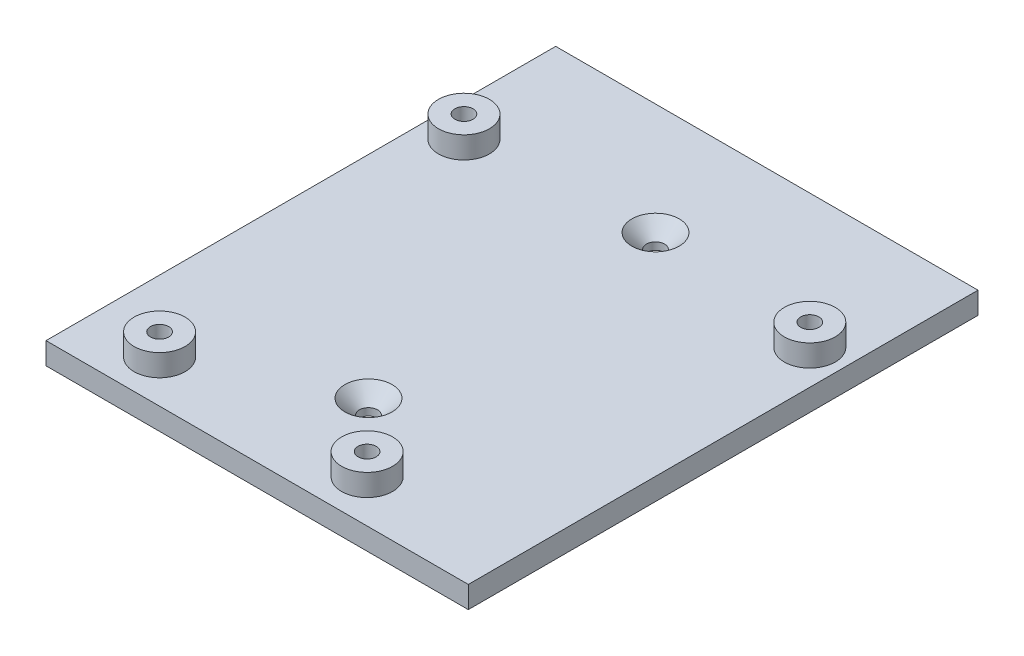
ISO-10303-21;
HEADER;
FILE_DESCRIPTION(('STEP AP214'),'2;1');
FILE_NAME('part.step','',(''),(''),'','','');
FILE_SCHEMA(('AUTOMOTIVE_DESIGN { 1 0 10303 214 1 1 1 1 }'));
ENDSEC;
DATA;
#1=APPLICATION_CONTEXT('core data for automotive mechanical design processes');
#2=APPLICATION_PROTOCOL_DEFINITION('international standard','automotive_design',2000,#1);
#3=PRODUCT_CONTEXT('',#1,'mechanical');
#4=PRODUCT('Part','Part','',(#3));
#5=PRODUCT_RELATED_PRODUCT_CATEGORY('part','',(#4));
#6=PRODUCT_DEFINITION_FORMATION('','',#4);
#7=PRODUCT_DEFINITION_CONTEXT('part definition',#1,'design');
#8=PRODUCT_DEFINITION('design','',#6,#7);
#9=PRODUCT_DEFINITION_SHAPE('','',#8);
#10=(LENGTH_UNIT() NAMED_UNIT(*) SI_UNIT(.MILLI.,.METRE.));
#11=(NAMED_UNIT(*) PLANE_ANGLE_UNIT() SI_UNIT($,.RADIAN.));
#12=(NAMED_UNIT(*) SI_UNIT($,.STERADIAN.) SOLID_ANGLE_UNIT());
#13=UNCERTAINTY_MEASURE_WITH_UNIT(LENGTH_MEASURE(1.E-05),#10,'distance_accuracy_value','');
#14=(GEOMETRIC_REPRESENTATION_CONTEXT(3) GLOBAL_UNCERTAINTY_ASSIGNED_CONTEXT((#13)) GLOBAL_UNIT_ASSIGNED_CONTEXT((#10,
#11,#12)) REPRESENTATION_CONTEXT('',''));
#15=CARTESIAN_POINT('',(0.,0.,0.));
#16=DIRECTION('',(0.,0.,1.));
#17=DIRECTION('',(1.,0.,0.));
#18=AXIS2_PLACEMENT_3D('',#15,#16,#17);
#19=CARTESIAN_POINT('',(-24.9419349390868,3.,-13.9533386698621));
#20=DIRECTION('',(1.,0.,0.));
#21=DIRECTION('',(0.,0.,-1.));
#22=AXIS2_PLACEMENT_3D('',#19,#20,#21);
#23=PLANE('',#22);
#24=DIRECTION('',(0.,0.,1.));
#25=VECTOR('',#24,1.);
#26=CARTESIAN_POINT('',(-24.9419349390868,0.,-13.9533386698621));
#27=LINE('',#26,#25);
#28=CARTESIAN_POINT('',(-24.9419349390868,0.,-13.9533386698621));
#29=VERTEX_POINT('',#28);
#30=CARTESIAN_POINT('',(-24.9419349390868,0.,56.0466613301379));
#31=VERTEX_POINT('',#30);
#32=EDGE_CURVE('E112',#29,#31,#27,.T.);
#33=ORIENTED_EDGE('',*,*,#32,.T.);
#34=DIRECTION('',(0.,-1.,0.));
#35=VECTOR('',#34,1.);
#36=CARTESIAN_POINT('',(-24.9419349390868,3.,56.0466613301379));
#37=LINE('',#36,#35);
#38=CARTESIAN_POINT('',(-24.9419349390868,3.,56.0466613301379));
#39=VERTEX_POINT('',#38);
#40=EDGE_CURVE('E104',#39,#31,#37,.T.);
#41=ORIENTED_EDGE('',*,*,#40,.F.);
#42=DIRECTION('',(0.,0.,1.));
#43=VECTOR('',#42,1.);
#44=CARTESIAN_POINT('',(-24.9419349390868,3.,-13.9533386698621));
#45=LINE('',#44,#43);
#46=CARTESIAN_POINT('',(-24.9419349390868,3.,-13.9533386698621));
#47=VERTEX_POINT('',#46);
#48=EDGE_CURVE('E95',#47,#39,#45,.T.);
#49=ORIENTED_EDGE('',*,*,#48,.F.);
#50=DIRECTION('',(0.,-1.,0.));
#51=VECTOR('',#50,1.);
#52=CARTESIAN_POINT('',(-24.9419349390868,3.,-13.9533386698621));
#53=LINE('',#52,#51);
#54=EDGE_CURVE('E61',#47,#29,#53,.T.);
#55=ORIENTED_EDGE('',*,*,#54,.T.);
#56=EDGE_LOOP('',(#33,#41,#49,#55));
#57=FACE_BOUND('',#56,.T.);
#58=ADVANCED_FACE('F43',(#57),#23,.F.);
#59=CARTESIAN_POINT('',(-24.9419349390868,3.,56.0466613301379));
#60=DIRECTION('',(0.,0.,-1.));
#61=DIRECTION('',(-1.,0.,0.));
#62=AXIS2_PLACEMENT_3D('',#59,#60,#61);
#63=PLANE('',#62);
#64=DIRECTION('',(1.,0.,0.));
#65=VECTOR('',#64,1.);
#66=CARTESIAN_POINT('',(-24.9419349390868,0.,56.0466613301379));
#67=LINE('',#66,#65);
#68=CARTESIAN_POINT('',(33.0580650609132,0.,56.0466613301379));
#69=VERTEX_POINT('',#68);
#70=EDGE_CURVE('E101',#31,#69,#67,.T.);
#71=ORIENTED_EDGE('',*,*,#70,.T.);
#72=DIRECTION('',(0.,-1.,0.));
#73=VECTOR('',#72,1.);
#74=CARTESIAN_POINT('',(33.0580650609132,3.,56.0466613301379));
#75=LINE('',#74,#73);
#76=CARTESIAN_POINT('',(33.0580650609132,3.,56.0466613301379));
#77=VERTEX_POINT('',#76);
#78=EDGE_CURVE('E99',#77,#69,#75,.T.);
#79=ORIENTED_EDGE('',*,*,#78,.F.);
#80=DIRECTION('',(1.,0.,0.));
#81=VECTOR('',#80,1.);
#82=CARTESIAN_POINT('',(-24.9419349390868,3.,56.0466613301379));
#83=LINE('',#82,#81);
#84=EDGE_CURVE('E87',#39,#77,#83,.T.);
#85=ORIENTED_EDGE('',*,*,#84,.F.);
#86=ORIENTED_EDGE('',*,*,#40,.T.);
#87=EDGE_LOOP('',(#71,#79,#85,#86));
#88=FACE_BOUND('',#87,.T.);
#89=ADVANCED_FACE('F100',(#88),#63,.F.);
#90=CARTESIAN_POINT('',(33.0580650609132,3.,-13.9533386698621));
#91=DIRECTION('',(1.,0.,0.));
#92=DIRECTION('',(0.,0.,-1.));
#93=AXIS2_PLACEMENT_3D('',#90,#91,#92);
#94=PLANE('',#93);
#95=DIRECTION('',(0.,0.,1.));
#96=VECTOR('',#95,1.);
#97=CARTESIAN_POINT('',(33.0580650609132,0.,-13.9533386698621));
#98=LINE('',#97,#96);
#99=CARTESIAN_POINT('',(33.0580650609132,0.,-13.9533386698621));
#100=VERTEX_POINT('',#99);
#101=EDGE_CURVE('E116',#100,#69,#98,.T.);
#102=ORIENTED_EDGE('',*,*,#101,.F.);
#103=DIRECTION('',(0.,-1.,0.));
#104=VECTOR('',#103,1.);
#105=CARTESIAN_POINT('',(33.0580650609132,3.,-13.9533386698621));
#106=LINE('',#105,#104);
#107=CARTESIAN_POINT('',(33.0580650609132,3.,-13.9533386698621));
#108=VERTEX_POINT('',#107);
#109=EDGE_CURVE('E75',#108,#100,#106,.T.);
#110=ORIENTED_EDGE('',*,*,#109,.F.);
#111=DIRECTION('',(0.,0.,1.));
#112=VECTOR('',#111,1.);
#113=CARTESIAN_POINT('',(33.0580650609132,3.,-13.9533386698621));
#114=LINE('',#113,#112);
#115=EDGE_CURVE('E94',#108,#77,#114,.T.);
#116=ORIENTED_EDGE('',*,*,#115,.T.);
#117=ORIENTED_EDGE('',*,*,#78,.T.);
#118=EDGE_LOOP('',(#102,#110,#116,#117));
#119=FACE_BOUND('',#118,.T.);
#120=ADVANCED_FACE('F106',(#119),#94,.T.);
#121=CARTESIAN_POINT('',(-24.9419349390868,3.,-13.9533386698621));
#122=DIRECTION('',(0.,0.,-1.));
#123=DIRECTION('',(-1.,0.,0.));
#124=AXIS2_PLACEMENT_3D('',#121,#122,#123);
#125=PLANE('',#124);
#126=DIRECTION('',(1.,0.,0.));
#127=VECTOR('',#126,1.);
#128=CARTESIAN_POINT('',(-24.9419349390868,0.,-13.9533386698621));
#129=LINE('',#128,#127);
#130=EDGE_CURVE('E118',#29,#100,#129,.T.);
#131=ORIENTED_EDGE('',*,*,#130,.F.);
#132=ORIENTED_EDGE('',*,*,#54,.F.);
#133=DIRECTION('',(1.,0.,0.));
#134=VECTOR('',#133,1.);
#135=CARTESIAN_POINT('',(-24.9419349390868,3.,-13.9533386698621));
#136=LINE('',#135,#134);
#137=EDGE_CURVE('E107',#47,#108,#136,.T.);
#138=ORIENTED_EDGE('',*,*,#137,.T.);
#139=ORIENTED_EDGE('',*,*,#109,.T.);
#140=EDGE_LOOP('',(#131,#132,#138,#139));
#141=FACE_BOUND('',#140,.T.);
#142=ADVANCED_FACE('F206',(#141),#125,.T.);
#143=CARTESIAN_POINT('',(0.,3.,0.));
#144=DIRECTION('',(0.,1.,0.));
#145=DIRECTION('',(0.,0.,1.));
#146=AXIS2_PLACEMENT_3D('',#143,#144,#145);
#147=PLANE('',#146);
#148=CARTESIAN_POINT('',(4.05806506091317,3.,40.7582003966033));
#149=DIRECTION('',(0.,1.,0.));
#150=DIRECTION('',(0.,0.,1.));
#151=AXIS2_PLACEMENT_3D('',#148,#149,#150);
#152=CIRCLE('',#151,3.25000000000003);
#153=CARTESIAN_POINT('',(4.05806506091317,3.,44.0082003966034));
#154=VERTEX_POINT('',#153);
#155=EDGE_CURVE('E53',#154,#154,#152,.F.);
#156=ORIENTED_EDGE('',*,*,#155,.T.);
#157=EDGE_LOOP('',(#156));
#158=FACE_BOUND('',#157,.T.);
#159=CARTESIAN_POINT('',(4.05806506091317,3.,1.33512226367241));
#160=DIRECTION('',(0.,1.,0.));
#161=DIRECTION('',(0.,0.,1.));
#162=AXIS2_PLACEMENT_3D('',#159,#160,#161);
#163=CIRCLE('',#162,3.25000000000002);
#164=CARTESIAN_POINT('',(4.05806506091317,3.,4.58512226367243));
#165=VERTEX_POINT('',#164);
#166=EDGE_CURVE('E139',#165,#165,#163,.F.);
#167=ORIENTED_EDGE('',*,*,#166,.T.);
#168=EDGE_LOOP('',(#167));
#169=FACE_BOUND('',#168,.T.);
#170=CARTESIAN_POINT('',(13.3080650609132,3.,50.1966613301379));
#171=DIRECTION('',(0.,1.,0.));
#172=DIRECTION('',(0.,0.,1.));
#173=AXIS2_PLACEMENT_3D('',#170,#171,#172);
#174=CIRCLE('',#173,3.5);
#175=CARTESIAN_POINT('',(13.3080650609132,3.,53.6966613301379));
#176=VERTEX_POINT('',#175);
#177=EDGE_CURVE('E167',#176,#176,#174,.T.);
#178=ORIENTED_EDGE('',*,*,#177,.F.);
#179=EDGE_LOOP('',(#178));
#180=FACE_BOUND('',#179,.T.);
#181=CARTESIAN_POINT('',(-20.1919349390868,3.,3.39666133013786));
#182=DIRECTION('',(0.,1.,0.));
#183=DIRECTION('',(0.,0.,1.));
#184=AXIS2_PLACEMENT_3D('',#181,#182,#183);
#185=CIRCLE('',#184,3.5);
#186=CARTESIAN_POINT('',(-20.1919349390868,3.,6.89666133013786));
#187=VERTEX_POINT('',#186);
#188=EDGE_CURVE('E176',#187,#187,#185,.T.);
#189=ORIENTED_EDGE('',*,*,#188,.F.);
#190=EDGE_LOOP('',(#189));
#191=FACE_BOUND('',#190,.T.);
#192=CARTESIAN_POINT('',(-15.1919349390868,3.,50.1966613301379));
#193=DIRECTION('',(0.,1.,0.));
#194=DIRECTION('',(0.,0.,1.));
#195=AXIS2_PLACEMENT_3D('',#192,#193,#194);
#196=CIRCLE('',#195,3.5);
#197=CARTESIAN_POINT('',(-15.1919349390868,3.,53.6966613301379));
#198=VERTEX_POINT('',#197);
#199=EDGE_CURVE('E185',#198,#198,#196,.T.);
#200=ORIENTED_EDGE('',*,*,#199,.F.);
#201=EDGE_LOOP('',(#200));
#202=FACE_BOUND('',#201,.T.);
#203=CARTESIAN_POINT('',(28.3080650609132,3.,4.39666133013786));
#204=DIRECTION('',(0.,1.,0.));
#205=DIRECTION('',(0.,0.,1.));
#206=AXIS2_PLACEMENT_3D('',#203,#204,#205);
#207=CIRCLE('',#206,3.5);
#208=CARTESIAN_POINT('',(28.3080650609132,3.,7.89666133013786));
#209=VERTEX_POINT('',#208);
#210=EDGE_CURVE('E196',#209,#209,#207,.T.);
#211=ORIENTED_EDGE('',*,*,#210,.F.);
#212=EDGE_LOOP('',(#211));
#213=FACE_BOUND('',#212,.T.);
#214=ORIENTED_EDGE('',*,*,#48,.T.);
#215=ORIENTED_EDGE('',*,*,#84,.T.);
#216=ORIENTED_EDGE('',*,*,#115,.F.);
#217=ORIENTED_EDGE('',*,*,#137,.F.);
#218=EDGE_LOOP('',(#214,#215,#216,#217));
#219=FACE_BOUND('',#218,.T.);
#220=ADVANCED_FACE('F91',(#158,#169,#180,#191,#202,#213,#219),#147,.T.);
#221=CARTESIAN_POINT('',(0.,0.,0.));
#222=DIRECTION('',(0.,1.,0.));
#223=DIRECTION('',(0.,0.,1.));
#224=AXIS2_PLACEMENT_3D('',#221,#222,#223);
#225=PLANE('',#224);
#226=CARTESIAN_POINT('',(4.05806506091317,0.,1.33512226367241));
#227=DIRECTION('',(0.,1.,0.));
#228=DIRECTION('',(0.,0.,1.));
#229=AXIS2_PLACEMENT_3D('',#226,#227,#228);
#230=CIRCLE('',#229,1.25);
#231=CARTESIAN_POINT('',(4.05806506091317,0.,2.58512226367242));
#232=VERTEX_POINT('',#231);
#233=EDGE_CURVE('E161',#232,#232,#230,.T.);
#234=ORIENTED_EDGE('',*,*,#233,.T.);
#235=EDGE_LOOP('',(#234));
#236=FACE_BOUND('',#235,.T.);
#237=CARTESIAN_POINT('',(4.05806506091317,0.,40.7582003966033));
#238=DIRECTION('',(0.,1.,0.));
#239=DIRECTION('',(0.,0.,-1.));
#240=AXIS2_PLACEMENT_3D('',#237,#238,#239);
#241=CIRCLE('',#240,1.25);
#242=CARTESIAN_POINT('',(4.05806506091317,0.,39.5082003966033));
#243=VERTEX_POINT('',#242);
#244=EDGE_CURVE('E159',#243,#243,#241,.T.);
#245=ORIENTED_EDGE('',*,*,#244,.T.);
#246=EDGE_LOOP('',(#245));
#247=FACE_BOUND('',#246,.T.);
#248=ORIENTED_EDGE('',*,*,#32,.F.);
#249=ORIENTED_EDGE('',*,*,#130,.T.);
#250=ORIENTED_EDGE('',*,*,#101,.T.);
#251=ORIENTED_EDGE('',*,*,#70,.F.);
#252=EDGE_LOOP('',(#248,#249,#250,#251));
#253=FACE_BOUND('',#252,.T.);
#254=ADVANCED_FACE('F205',(#236,#247,#253),#225,.F.);
#255=CARTESIAN_POINT('',(28.3080650609132,6.,4.39666133013786));
#256=DIRECTION('',(0.,1.,0.));
#257=DIRECTION('',(0.,0.,1.));
#258=AXIS2_PLACEMENT_3D('',#255,#256,#257);
#259=PLANE('',#258);
#260=CARTESIAN_POINT('',(28.3080650609132,6.,4.39666133013786));
#261=DIRECTION('',(0.,1.,0.));
#262=DIRECTION('',(0.,0.,1.));
#263=AXIS2_PLACEMENT_3D('',#260,#261,#262);
#264=CIRCLE('',#263,3.5);
#265=CARTESIAN_POINT('',(28.3080650609132,6.,7.89666133013786));
#266=VERTEX_POINT('',#265);
#267=EDGE_CURVE('E114',#266,#266,#264,.T.);
#268=ORIENTED_EDGE('',*,*,#267,.T.);
#269=EDGE_LOOP('',(#268));
#270=FACE_BOUND('',#269,.T.);
#271=CARTESIAN_POINT('',(28.3080650609132,6.,4.39666133013786));
#272=DIRECTION('',(0.,1.,0.));
#273=DIRECTION('',(0.,0.,1.));
#274=AXIS2_PLACEMENT_3D('',#271,#272,#273);
#275=CIRCLE('',#274,1.25);
#276=CARTESIAN_POINT('',(28.3080650609132,6.,5.64666133013786));
#277=VERTEX_POINT('',#276);
#278=EDGE_CURVE('E193',#277,#277,#275,.T.);
#279=ORIENTED_EDGE('',*,*,#278,.F.);
#280=EDGE_LOOP('',(#279));
#281=FACE_BOUND('',#280,.T.);
#282=ADVANCED_FACE('F212',(#270,#281),#259,.T.);
#283=CARTESIAN_POINT('',(28.3080650609132,6.,4.39666133013786));
#284=DIRECTION('',(0.,-1.,0.));
#285=DIRECTION('',(0.,0.,-1.));
#286=AXIS2_PLACEMENT_3D('',#283,#284,#285);
#287=CYLINDRICAL_SURFACE('',#286,3.5);
#288=ORIENTED_EDGE('',*,*,#267,.F.);
#289=EDGE_LOOP('',(#288));
#290=FACE_BOUND('',#289,.T.);
#291=ORIENTED_EDGE('',*,*,#210,.T.);
#292=EDGE_LOOP('',(#291));
#293=FACE_BOUND('',#292,.T.);
#294=ADVANCED_FACE('F202',(#290,#293),#287,.T.);
#295=CARTESIAN_POINT('',(28.3080650609132,6.,4.39666133013786));
#296=DIRECTION('',(0.,-1.,0.));
#297=DIRECTION('',(0.,0.,-1.));
#298=AXIS2_PLACEMENT_3D('',#295,#296,#297);
#299=CYLINDRICAL_SURFACE('',#298,1.25);
#300=ORIENTED_EDGE('',*,*,#278,.T.);
#301=EDGE_LOOP('',(#300));
#302=FACE_BOUND('',#301,.T.);
#303=CARTESIAN_POINT('',(28.3080650609132,3.,4.39666133013786));
#304=DIRECTION('',(0.,1.,0.));
#305=DIRECTION('',(0.,0.,1.));
#306=AXIS2_PLACEMENT_3D('',#303,#304,#305);
#307=CIRCLE('',#306,1.25);
#308=CARTESIAN_POINT('',(28.3080650609132,3.,5.64666133013786));
#309=VERTEX_POINT('',#308);
#310=EDGE_CURVE('E124',#309,#309,#307,.F.);
#311=ORIENTED_EDGE('',*,*,#310,.T.);
#312=EDGE_LOOP('',(#311));
#313=FACE_BOUND('',#312,.T.);
#314=ADVANCED_FACE('F224',(#302,#313),#299,.F.);
#315=ORIENTED_EDGE('',*,*,#310,.F.);
#316=EDGE_LOOP('',(#315));
#317=FACE_BOUND('',#316,.T.);
#318=ADVANCED_FACE('F208',(#317),#147,.T.);
#319=CARTESIAN_POINT('',(-15.1919349390868,6.,50.1966613301379));
#320=DIRECTION('',(0.,1.,0.));
#321=DIRECTION('',(0.,0.,1.));
#322=AXIS2_PLACEMENT_3D('',#319,#320,#321);
#323=PLANE('',#322);
#324=CARTESIAN_POINT('',(-15.1919349390868,6.,50.1966613301379));
#325=DIRECTION('',(0.,1.,0.));
#326=DIRECTION('',(0.,0.,1.));
#327=AXIS2_PLACEMENT_3D('',#324,#325,#326);
#328=CIRCLE('',#327,3.5);
#329=CARTESIAN_POINT('',(-15.1919349390868,6.,53.6966613301379));
#330=VERTEX_POINT('',#329);
#331=EDGE_CURVE('E184',#330,#330,#328,.T.);
#332=ORIENTED_EDGE('',*,*,#331,.T.);
#333=EDGE_LOOP('',(#332));
#334=FACE_BOUND('',#333,.T.);
#335=CARTESIAN_POINT('',(-15.1919349390868,6.,50.1966613301379));
#336=DIRECTION('',(0.,1.,0.));
#337=DIRECTION('',(0.,0.,1.));
#338=AXIS2_PLACEMENT_3D('',#335,#336,#337);
#339=CIRCLE('',#338,1.25);
#340=CARTESIAN_POINT('',(-15.1919349390868,6.,51.4466613301379));
#341=VERTEX_POINT('',#340);
#342=EDGE_CURVE('E188',#341,#341,#339,.T.);
#343=ORIENTED_EDGE('',*,*,#342,.F.);
#344=EDGE_LOOP('',(#343));
#345=FACE_BOUND('',#344,.T.);
#346=ADVANCED_FACE('F223',(#334,#345),#323,.T.);
#347=CARTESIAN_POINT('',(-15.1919349390868,6.,50.1966613301379));
#348=DIRECTION('',(0.,-1.,0.));
#349=DIRECTION('',(0.,0.,-1.));
#350=AXIS2_PLACEMENT_3D('',#347,#348,#349);
#351=CYLINDRICAL_SURFACE('',#350,3.5);
#352=ORIENTED_EDGE('',*,*,#331,.F.);
#353=EDGE_LOOP('',(#352));
#354=FACE_BOUND('',#353,.T.);
#355=ORIENTED_EDGE('',*,*,#199,.T.);
#356=EDGE_LOOP('',(#355));
#357=FACE_BOUND('',#356,.T.);
#358=ADVANCED_FACE('F286',(#354,#357),#351,.T.);
#359=CARTESIAN_POINT('',(-15.1919349390868,6.,50.1966613301379));
#360=DIRECTION('',(0.,-1.,0.));
#361=DIRECTION('',(0.,0.,-1.));
#362=AXIS2_PLACEMENT_3D('',#359,#360,#361);
#363=CYLINDRICAL_SURFACE('',#362,1.25);
#364=ORIENTED_EDGE('',*,*,#342,.T.);
#365=EDGE_LOOP('',(#364));
#366=FACE_BOUND('',#365,.T.);
#367=CARTESIAN_POINT('',(-15.1919349390868,3.,50.1966613301379));
#368=DIRECTION('',(0.,1.,0.));
#369=DIRECTION('',(0.,0.,1.));
#370=AXIS2_PLACEMENT_3D('',#367,#368,#369);
#371=CIRCLE('',#370,1.25);
#372=CARTESIAN_POINT('',(-15.1919349390868,3.,51.4466613301379));
#373=VERTEX_POINT('',#372);
#374=EDGE_CURVE('E127',#373,#373,#371,.F.);
#375=ORIENTED_EDGE('',*,*,#374,.T.);
#376=EDGE_LOOP('',(#375));
#377=FACE_BOUND('',#376,.T.);
#378=ADVANCED_FACE('F295',(#366,#377),#363,.F.);
#379=ORIENTED_EDGE('',*,*,#374,.F.);
#380=EDGE_LOOP('',(#379));
#381=FACE_BOUND('',#380,.T.);
#382=ADVANCED_FACE('F226',(#381),#147,.T.);
#383=CARTESIAN_POINT('',(-20.1919349390868,6.,3.39666133013786));
#384=DIRECTION('',(0.,1.,0.));
#385=DIRECTION('',(0.,0.,1.));
#386=AXIS2_PLACEMENT_3D('',#383,#384,#385);
#387=PLANE('',#386);
#388=CARTESIAN_POINT('',(-20.1919349390868,6.,3.39666133013786));
#389=DIRECTION('',(0.,1.,0.));
#390=DIRECTION('',(0.,0.,1.));
#391=AXIS2_PLACEMENT_3D('',#388,#389,#390);
#392=CIRCLE('',#391,3.5);
#393=CARTESIAN_POINT('',(-20.1919349390868,6.,6.89666133013786));
#394=VERTEX_POINT('',#393);
#395=EDGE_CURVE('E175',#394,#394,#392,.T.);
#396=ORIENTED_EDGE('',*,*,#395,.T.);
#397=EDGE_LOOP('',(#396));
#398=FACE_BOUND('',#397,.T.);
#399=CARTESIAN_POINT('',(-20.1919349390868,6.,3.39666133013786));
#400=DIRECTION('',(0.,1.,0.));
#401=DIRECTION('',(0.,0.,1.));
#402=AXIS2_PLACEMENT_3D('',#399,#400,#401);
#403=CIRCLE('',#402,1.25);
#404=CARTESIAN_POINT('',(-20.1919349390868,6.,4.64666133013786));
#405=VERTEX_POINT('',#404);
#406=EDGE_CURVE('E179',#405,#405,#403,.T.);
#407=ORIENTED_EDGE('',*,*,#406,.F.);
#408=EDGE_LOOP('',(#407));
#409=FACE_BOUND('',#408,.T.);
#410=ADVANCED_FACE('F312',(#398,#409),#387,.T.);
#411=CARTESIAN_POINT('',(-20.1919349390868,6.,3.39666133013786));
#412=DIRECTION('',(0.,-1.,0.));
#413=DIRECTION('',(0.,0.,-1.));
#414=AXIS2_PLACEMENT_3D('',#411,#412,#413);
#415=CYLINDRICAL_SURFACE('',#414,3.5);
#416=ORIENTED_EDGE('',*,*,#395,.F.);
#417=EDGE_LOOP('',(#416));
#418=FACE_BOUND('',#417,.T.);
#419=ORIENTED_EDGE('',*,*,#188,.T.);
#420=EDGE_LOOP('',(#419));
#421=FACE_BOUND('',#420,.T.);
#422=ADVANCED_FACE('F319',(#418,#421),#415,.T.);
#423=CARTESIAN_POINT('',(-20.1919349390868,6.,3.39666133013786));
#424=DIRECTION('',(0.,-1.,0.));
#425=DIRECTION('',(0.,0.,-1.));
#426=AXIS2_PLACEMENT_3D('',#423,#424,#425);
#427=CYLINDRICAL_SURFACE('',#426,1.25);
#428=ORIENTED_EDGE('',*,*,#406,.T.);
#429=EDGE_LOOP('',(#428));
#430=FACE_BOUND('',#429,.T.);
#431=CARTESIAN_POINT('',(-20.1919349390868,3.,3.39666133013786));
#432=DIRECTION('',(0.,1.,0.));
#433=DIRECTION('',(0.,0.,1.));
#434=AXIS2_PLACEMENT_3D('',#431,#432,#433);
#435=CIRCLE('',#434,1.25);
#436=CARTESIAN_POINT('',(-20.1919349390868,3.,4.64666133013786));
#437=VERTEX_POINT('',#436);
#438=EDGE_CURVE('E130',#437,#437,#435,.F.);
#439=ORIENTED_EDGE('',*,*,#438,.T.);
#440=EDGE_LOOP('',(#439));
#441=FACE_BOUND('',#440,.T.);
#442=ADVANCED_FACE('F328',(#430,#441),#427,.F.);
#443=ORIENTED_EDGE('',*,*,#438,.F.);
#444=EDGE_LOOP('',(#443));
#445=FACE_BOUND('',#444,.T.);
#446=ADVANCED_FACE('F221',(#445),#147,.T.);
#447=CARTESIAN_POINT('',(13.3080650609132,6.,50.1966613301379));
#448=DIRECTION('',(0.,1.,0.));
#449=DIRECTION('',(0.,0.,1.));
#450=AXIS2_PLACEMENT_3D('',#447,#448,#449);
#451=PLANE('',#450);
#452=CARTESIAN_POINT('',(13.3080650609132,6.,50.1966613301379));
#453=DIRECTION('',(0.,1.,0.));
#454=DIRECTION('',(0.,0.,1.));
#455=AXIS2_PLACEMENT_3D('',#452,#453,#454);
#456=CIRCLE('',#455,3.5);
#457=CARTESIAN_POINT('',(13.3080650609132,6.,53.6966613301379));
#458=VERTEX_POINT('',#457);
#459=EDGE_CURVE('E164',#458,#458,#456,.T.);
#460=ORIENTED_EDGE('',*,*,#459,.T.);
#461=EDGE_LOOP('',(#460));
#462=FACE_BOUND('',#461,.T.);
#463=CARTESIAN_POINT('',(13.3080650609132,6.,50.1966613301379));
#464=DIRECTION('',(0.,1.,0.));
#465=DIRECTION('',(0.,0.,1.));
#466=AXIS2_PLACEMENT_3D('',#463,#464,#465);
#467=CIRCLE('',#466,1.25);
#468=CARTESIAN_POINT('',(13.3080650609132,6.,51.4466613301379));
#469=VERTEX_POINT('',#468);
#470=EDGE_CURVE('E170',#469,#469,#467,.T.);
#471=ORIENTED_EDGE('',*,*,#470,.F.);
#472=EDGE_LOOP('',(#471));
#473=FACE_BOUND('',#472,.T.);
#474=ADVANCED_FACE('F345',(#462,#473),#451,.T.);
#475=CARTESIAN_POINT('',(13.3080650609132,6.,50.1966613301379));
#476=DIRECTION('',(0.,-1.,0.));
#477=DIRECTION('',(0.,0.,-1.));
#478=AXIS2_PLACEMENT_3D('',#475,#476,#477);
#479=CYLINDRICAL_SURFACE('',#478,3.5);
#480=ORIENTED_EDGE('',*,*,#459,.F.);
#481=EDGE_LOOP('',(#480));
#482=FACE_BOUND('',#481,.T.);
#483=ORIENTED_EDGE('',*,*,#177,.T.);
#484=EDGE_LOOP('',(#483));
#485=FACE_BOUND('',#484,.T.);
#486=ADVANCED_FACE('F352',(#482,#485),#479,.T.);
#487=CARTESIAN_POINT('',(13.3080650609132,6.,50.1966613301379));
#488=DIRECTION('',(0.,-1.,0.));
#489=DIRECTION('',(0.,0.,-1.));
#490=AXIS2_PLACEMENT_3D('',#487,#488,#489);
#491=CYLINDRICAL_SURFACE('',#490,1.25);
#492=ORIENTED_EDGE('',*,*,#470,.T.);
#493=EDGE_LOOP('',(#492));
#494=FACE_BOUND('',#493,.T.);
#495=CARTESIAN_POINT('',(13.3080650609132,3.,50.1966613301379));
#496=DIRECTION('',(0.,1.,0.));
#497=DIRECTION('',(0.,0.,1.));
#498=AXIS2_PLACEMENT_3D('',#495,#496,#497);
#499=CIRCLE('',#498,1.25);
#500=CARTESIAN_POINT('',(13.3080650609132,3.,51.4466613301379));
#501=VERTEX_POINT('',#500);
#502=EDGE_CURVE('E133',#501,#501,#499,.F.);
#503=ORIENTED_EDGE('',*,*,#502,.T.);
#504=EDGE_LOOP('',(#503));
#505=FACE_BOUND('',#504,.T.);
#506=ADVANCED_FACE('F219',(#494,#505),#491,.F.);
#507=ORIENTED_EDGE('',*,*,#502,.F.);
#508=EDGE_LOOP('',(#507));
#509=FACE_BOUND('',#508,.T.);
#510=ADVANCED_FACE('F155',(#509),#147,.T.);
#511=CARTESIAN_POINT('',(4.05806506091317,0.,40.7582003966033));
#512=DIRECTION('',(0.,1.,0.));
#513=DIRECTION('',(0.,0.,1.));
#514=AXIS2_PLACEMENT_3D('',#511,#512,#513);
#515=CYLINDRICAL_SURFACE('',#514,1.25);
#516=CARTESIAN_POINT('',(4.05806506091317,0.999999999999979,40.7582003966033));
#517=DIRECTION('',(0.,1.,0.));
#518=DIRECTION('',(0.,0.,1.));
#519=AXIS2_PLACEMENT_3D('',#516,#517,#518);
#520=CIRCLE('',#519,1.25);
#521=CARTESIAN_POINT('',(4.05806506091317,0.999999999999979,42.0082003966033));
#522=VERTEX_POINT('',#521);
#523=EDGE_CURVE('E136',#522,#522,#520,.T.);
#524=ORIENTED_EDGE('',*,*,#523,.T.);
#525=EDGE_LOOP('',(#524));
#526=FACE_BOUND('',#525,.T.);
#527=ORIENTED_EDGE('',*,*,#244,.F.);
#528=EDGE_LOOP('',(#527));
#529=FACE_BOUND('',#528,.T.);
#530=ADVANCED_FACE('F152',(#526,#529),#515,.F.);
#531=CARTESIAN_POINT('',(4.05806506091317,0.,1.33512226367241));
#532=DIRECTION('',(0.,1.,0.));
#533=DIRECTION('',(0.,0.,1.));
#534=AXIS2_PLACEMENT_3D('',#531,#532,#533);
#535=CYLINDRICAL_SURFACE('',#534,1.25);
#536=CARTESIAN_POINT('',(4.05806506091317,0.999999999999993,1.33512226367241));
#537=DIRECTION('',(0.,1.,0.));
#538=DIRECTION('',(0.,0.,1.));
#539=AXIS2_PLACEMENT_3D('',#536,#537,#538);
#540=CIRCLE('',#539,1.25);
#541=CARTESIAN_POINT('',(4.05806506091317,0.999999999999993,2.58512226367242));
#542=VERTEX_POINT('',#541);
#543=EDGE_CURVE('E11',#542,#542,#540,.T.);
#544=ORIENTED_EDGE('',*,*,#543,.T.);
#545=EDGE_LOOP('',(#544));
#546=FACE_BOUND('',#545,.T.);
#547=ORIENTED_EDGE('',*,*,#233,.F.);
#548=EDGE_LOOP('',(#547));
#549=FACE_BOUND('',#548,.T.);
#550=ADVANCED_FACE('F149',(#546,#549),#535,.F.);
#551=CARTESIAN_POINT('',(4.05806506091317,0.999999999999979,40.7582003966033));
#552=DIRECTION('',(0.,1.,0.));
#553=DIRECTION('',(0.,0.,1.));
#554=AXIS2_PLACEMENT_3D('',#551,#552,#553);
#555=CONICAL_SURFACE('',#554,1.25,0.785398163397451);
#556=ORIENTED_EDGE('',*,*,#155,.F.);
#557=EDGE_LOOP('',(#556));
#558=FACE_BOUND('',#557,.T.);
#559=ORIENTED_EDGE('',*,*,#523,.F.);
#560=EDGE_LOOP('',(#559));
#561=FACE_BOUND('',#560,.T.);
#562=ADVANCED_FACE('F146',(#558,#561),#555,.F.);
#563=CARTESIAN_POINT('',(4.05806506091317,0.999999999999993,1.33512226367241));
#564=DIRECTION('',(0.,1.,0.));
#565=DIRECTION('',(0.,0.,1.));
#566=AXIS2_PLACEMENT_3D('',#563,#564,#565);
#567=CONICAL_SURFACE('',#566,1.25,0.785398163397451);
#568=ORIENTED_EDGE('',*,*,#166,.F.);
#569=EDGE_LOOP('',(#568));
#570=FACE_BOUND('',#569,.T.);
#571=ORIENTED_EDGE('',*,*,#543,.F.);
#572=EDGE_LOOP('',(#571));
#573=FACE_BOUND('',#572,.T.);
#574=ADVANCED_FACE('F46',(#570,#573),#567,.F.);
#575=CLOSED_SHELL('',(#58,#89,#120,#142,#220,#254,#282,#294,#314,#318,#346,#358,#378,#382,#410,
#422,#442,#446,#474,#486,#506,#510,#530,#550,#562,#574));
#576=MANIFOLD_SOLID_BREP('B2',#575);
#577=ADVANCED_BREP_SHAPE_REPRESENTATION('',(#18,#576),#14);
#578=SHAPE_DEFINITION_REPRESENTATION(#9,#577);
ENDSEC;
END-ISO-10303-21;
